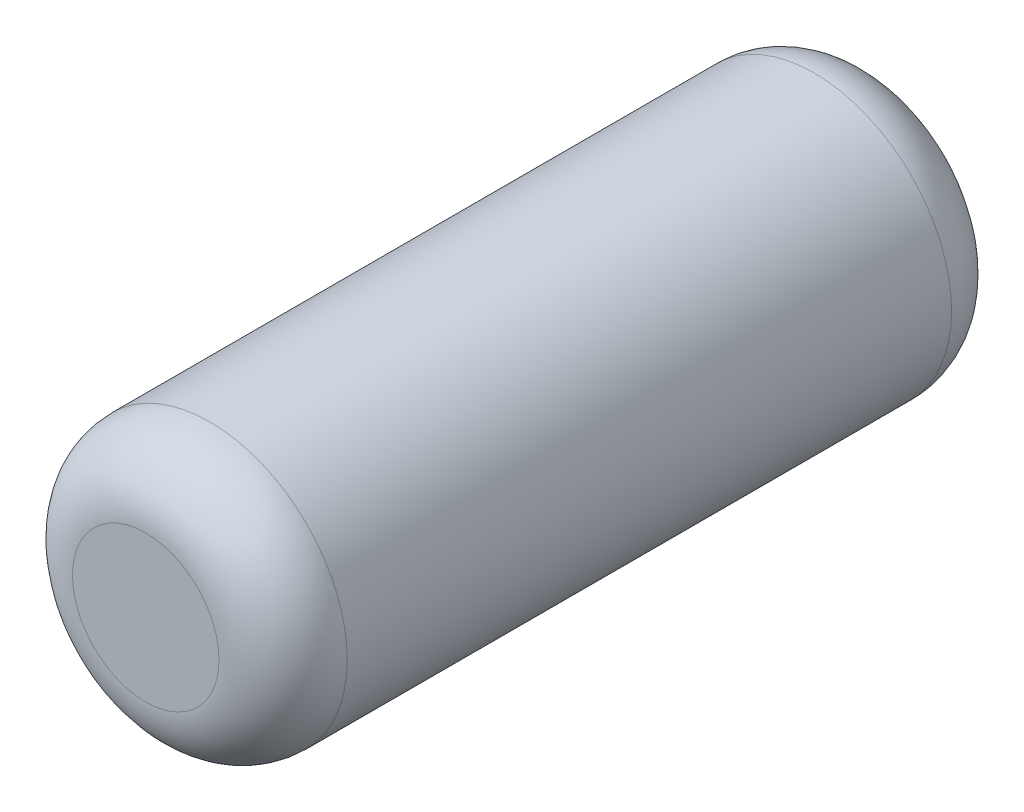
ISO-10303-21;
HEADER;
FILE_DESCRIPTION(('STEP AP214'),'2;1');
FILE_NAME('part.step','',(''),(''),'','','');
FILE_SCHEMA(('AUTOMOTIVE_DESIGN { 1 0 10303 214 1 1 1 1 }'));
ENDSEC;
DATA;
#1=APPLICATION_CONTEXT('core data for automotive mechanical design processes');
#2=APPLICATION_PROTOCOL_DEFINITION('international standard','automotive_design',2000,#1);
#3=PRODUCT_CONTEXT('',#1,'mechanical');
#4=PRODUCT('Part','Part','',(#3));
#5=PRODUCT_RELATED_PRODUCT_CATEGORY('part','',(#4));
#6=PRODUCT_DEFINITION_FORMATION('','',#4);
#7=PRODUCT_DEFINITION_CONTEXT('part definition',#1,'design');
#8=PRODUCT_DEFINITION('design','',#6,#7);
#9=PRODUCT_DEFINITION_SHAPE('','',#8);
#10=(LENGTH_UNIT() NAMED_UNIT(*) SI_UNIT(.MILLI.,.METRE.));
#11=(NAMED_UNIT(*) PLANE_ANGLE_UNIT() SI_UNIT($,.RADIAN.));
#12=(NAMED_UNIT(*) SI_UNIT($,.STERADIAN.) SOLID_ANGLE_UNIT());
#13=UNCERTAINTY_MEASURE_WITH_UNIT(LENGTH_MEASURE(1.E-05),#10,'distance_accuracy_value','');
#14=(GEOMETRIC_REPRESENTATION_CONTEXT(3) GLOBAL_UNCERTAINTY_ASSIGNED_CONTEXT((#13)) GLOBAL_UNIT_ASSIGNED_CONTEXT((#10,
#11,#12)) REPRESENTATION_CONTEXT('',''));
#15=CARTESIAN_POINT('',(0.,0.,0.));
#16=DIRECTION('',(0.,0.,1.));
#17=DIRECTION('',(1.,0.,0.));
#18=AXIS2_PLACEMENT_3D('',#15,#16,#17);
#19=CARTESIAN_POINT('',(0.,0.,2.));
#20=DIRECTION('',(0.,0.,-1.));
#21=DIRECTION('',(-1.,0.,0.));
#22=AXIS2_PLACEMENT_3D('',#19,#20,#21);
#23=CYLINDRICAL_SURFACE('',#22,0.75);
#24=CARTESIAN_POINT('',(0.,0.,-1.65));
#25=DIRECTION('',(0.,0.,1.));
#26=DIRECTION('',(1.,0.,0.));
#27=AXIS2_PLACEMENT_3D('',#24,#25,#26);
#28=CIRCLE('',#27,0.75);
#29=CARTESIAN_POINT('',(0.75,0.,-1.65));
#30=VERTEX_POINT('',#29);
#31=EDGE_CURVE('E42',#30,#30,#28,.T.);
#32=ORIENTED_EDGE('',*,*,#31,.T.);
#33=EDGE_LOOP('',(#32));
#34=FACE_BOUND('',#33,.T.);
#35=CARTESIAN_POINT('',(0.,0.,1.65));
#36=DIRECTION('',(0.,0.,1.));
#37=DIRECTION('',(1.,0.,0.));
#38=AXIS2_PLACEMENT_3D('',#35,#36,#37);
#39=CIRCLE('',#38,0.75);
#40=CARTESIAN_POINT('',(0.75,0.,1.65));
#41=VERTEX_POINT('',#40);
#42=EDGE_CURVE('E46',#41,#41,#39,.F.);
#43=ORIENTED_EDGE('',*,*,#42,.T.);
#44=EDGE_LOOP('',(#43));
#45=FACE_BOUND('',#44,.T.);
#46=ADVANCED_FACE('F31',(#34,#45),#23,.T.);
#47=CARTESIAN_POINT('',(0.,0.,2.));
#48=DIRECTION('',(0.,0.,1.));
#49=DIRECTION('',(1.,0.,0.));
#50=AXIS2_PLACEMENT_3D('',#47,#48,#49);
#51=PLANE('',#50);
#52=CARTESIAN_POINT('',(0.,0.,2.));
#53=DIRECTION('',(0.,0.,1.));
#54=DIRECTION('',(1.,0.,0.));
#55=AXIS2_PLACEMENT_3D('',#52,#53,#54);
#56=CIRCLE('',#55,0.4);
#57=CARTESIAN_POINT('',(0.4,0.,2.));
#58=VERTEX_POINT('',#57);
#59=EDGE_CURVE('E10',#58,#58,#56,.T.);
#60=ORIENTED_EDGE('',*,*,#59,.T.);
#61=EDGE_LOOP('',(#60));
#62=FACE_BOUND('',#61,.T.);
#63=ADVANCED_FACE('F62',(#62),#51,.T.);
#64=CARTESIAN_POINT('',(0.,0.,-2.));
#65=DIRECTION('',(0.,0.,1.));
#66=DIRECTION('',(1.,0.,0.));
#67=AXIS2_PLACEMENT_3D('',#64,#65,#66);
#68=PLANE('',#67);
#69=CARTESIAN_POINT('',(0.,0.,-2.));
#70=DIRECTION('',(0.,0.,1.));
#71=DIRECTION('',(1.,0.,0.));
#72=AXIS2_PLACEMENT_3D('',#69,#70,#71);
#73=CIRCLE('',#72,0.4);
#74=CARTESIAN_POINT('',(0.4,0.,-2.));
#75=VERTEX_POINT('',#74);
#76=EDGE_CURVE('E38',#75,#75,#73,.F.);
#77=ORIENTED_EDGE('',*,*,#76,.T.);
#78=EDGE_LOOP('',(#77));
#79=FACE_BOUND('',#78,.T.);
#80=ADVANCED_FACE('F59',(#79),#68,.F.);
#81=CARTESIAN_POINT('',(0.,0.,-1.65));
#82=DIRECTION('',(0.,0.,1.));
#83=DIRECTION('',(1.,0.,0.));
#84=AXIS2_PLACEMENT_3D('',#81,#82,#83);
#85=TOROIDAL_SURFACE('',#84,0.4,0.35);
#86=ORIENTED_EDGE('',*,*,#76,.F.);
#87=EDGE_LOOP('',(#86));
#88=FACE_BOUND('',#87,.T.);
#89=ORIENTED_EDGE('',*,*,#31,.F.);
#90=EDGE_LOOP('',(#89));
#91=FACE_BOUND('',#90,.T.);
#92=ADVANCED_FACE('F55',(#88,#91),#85,.T.);
#93=CARTESIAN_POINT('',(0.,0.,1.65));
#94=DIRECTION('',(0.,0.,1.));
#95=DIRECTION('',(1.,0.,0.));
#96=AXIS2_PLACEMENT_3D('',#93,#94,#95);
#97=TOROIDAL_SURFACE('',#96,0.4,0.35);
#98=ORIENTED_EDGE('',*,*,#42,.F.);
#99=EDGE_LOOP('',(#98));
#100=FACE_BOUND('',#99,.T.);
#101=ORIENTED_EDGE('',*,*,#59,.F.);
#102=EDGE_LOOP('',(#101));
#103=FACE_BOUND('',#102,.T.);
#104=ADVANCED_FACE('F33',(#100,#103),#97,.T.);
#105=CLOSED_SHELL('',(#46,#63,#80,#92,#104));
#106=MANIFOLD_SOLID_BREP('B2',#105);
#107=ADVANCED_BREP_SHAPE_REPRESENTATION('',(#18,#106),#14);
#108=SHAPE_DEFINITION_REPRESENTATION(#9,#107);
ENDSEC;
END-ISO-10303-21;
